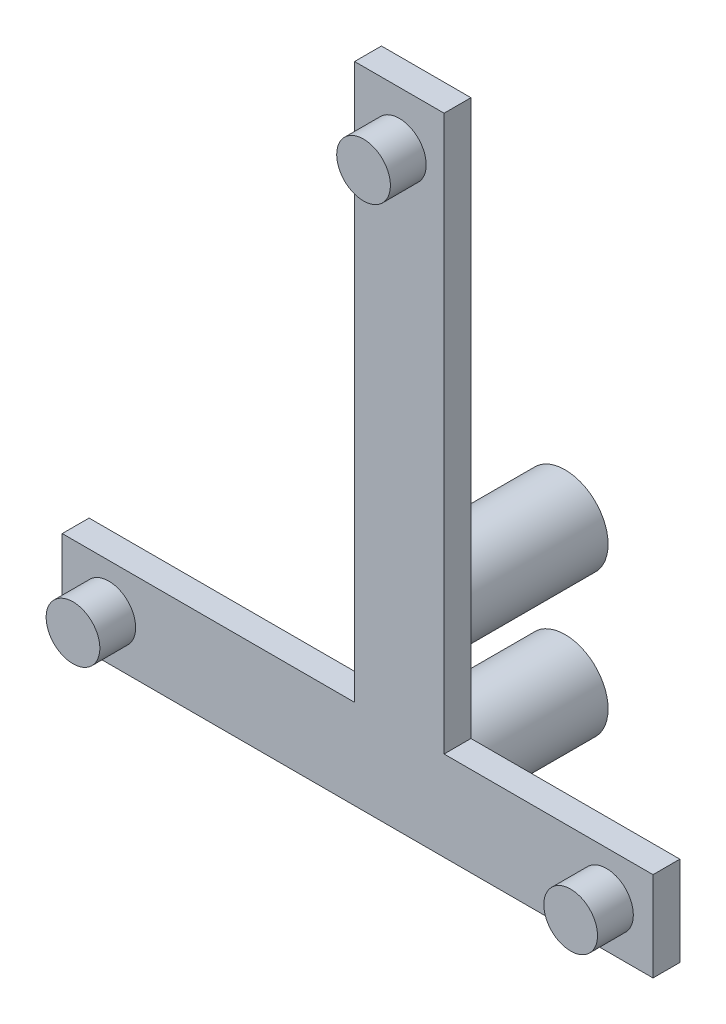
ISO-10303-21;
HEADER;
FILE_DESCRIPTION(('STEP AP214'),'2;1');
FILE_NAME('part.step','',(''),(''),'','','');
FILE_SCHEMA(('AUTOMOTIVE_DESIGN { 1 0 10303 214 1 1 1 1 }'));
ENDSEC;
DATA;
#1=APPLICATION_CONTEXT('core data for automotive mechanical design processes');
#2=APPLICATION_PROTOCOL_DEFINITION('international standard','automotive_design',2000,#1);
#3=PRODUCT_CONTEXT('',#1,'mechanical');
#4=PRODUCT('Part','Part','',(#3));
#5=PRODUCT_RELATED_PRODUCT_CATEGORY('part','',(#4));
#6=PRODUCT_DEFINITION_FORMATION('','',#4);
#7=PRODUCT_DEFINITION_CONTEXT('part definition',#1,'design');
#8=PRODUCT_DEFINITION('design','',#6,#7);
#9=PRODUCT_DEFINITION_SHAPE('','',#8);
#10=(LENGTH_UNIT() NAMED_UNIT(*) SI_UNIT(.MILLI.,.METRE.));
#11=(NAMED_UNIT(*) PLANE_ANGLE_UNIT() SI_UNIT($,.RADIAN.));
#12=(NAMED_UNIT(*) SI_UNIT($,.STERADIAN.) SOLID_ANGLE_UNIT());
#13=UNCERTAINTY_MEASURE_WITH_UNIT(LENGTH_MEASURE(1.E-05),#10,'distance_accuracy_value','');
#14=(GEOMETRIC_REPRESENTATION_CONTEXT(3) GLOBAL_UNCERTAINTY_ASSIGNED_CONTEXT((#13)) GLOBAL_UNIT_ASSIGNED_CONTEXT((#10,
#11,#12)) REPRESENTATION_CONTEXT('',''));
#15=CARTESIAN_POINT('',(0.,0.,0.));
#16=DIRECTION('',(0.,0.,1.));
#17=DIRECTION('',(1.,0.,0.));
#18=AXIS2_PLACEMENT_3D('',#15,#16,#17);
#19=CARTESIAN_POINT('',(-139.561248012313,21.0705350306475,1.5));
#20=DIRECTION('',(1.,0.,0.));
#21=DIRECTION('',(0.,0.,-1.));
#22=AXIS2_PLACEMENT_3D('',#19,#20,#21);
#23=PLANE('',#22);
#24=DIRECTION('',(0.,-1.,0.));
#25=VECTOR('',#24,1.);
#26=CARTESIAN_POINT('',(-139.561248012313,21.0705350306475,0.));
#27=LINE('',#26,#25);
#28=CARTESIAN_POINT('',(-139.561248012313,21.0705350306475,0.));
#29=VERTEX_POINT('',#28);
#30=CARTESIAN_POINT('',(-139.561248012313,16.0705350306475,0.));
#31=VERTEX_POINT('',#30);
#32=EDGE_CURVE('E132',#29,#31,#27,.T.);
#33=ORIENTED_EDGE('',*,*,#32,.T.);
#34=DIRECTION('',(0.,0.,-1.));
#35=VECTOR('',#34,1.);
#36=CARTESIAN_POINT('',(-139.561248012313,16.0705350306475,1.5));
#37=LINE('',#36,#35);
#38=CARTESIAN_POINT('',(-139.561248012313,16.0705350306475,1.5));
#39=VERTEX_POINT('',#38);
#40=EDGE_CURVE('E160',#39,#31,#37,.T.);
#41=ORIENTED_EDGE('',*,*,#40,.F.);
#42=DIRECTION('',(0.,-1.,0.));
#43=VECTOR('',#42,1.);
#44=CARTESIAN_POINT('',(-139.561248012313,21.0705350306475,1.5));
#45=LINE('',#44,#43);
#46=CARTESIAN_POINT('',(-139.561248012313,21.0705350306475,1.5));
#47=VERTEX_POINT('',#46);
#48=EDGE_CURVE('E147',#47,#39,#45,.T.);
#49=ORIENTED_EDGE('',*,*,#48,.F.);
#50=DIRECTION('',(0.,0.,-1.));
#51=VECTOR('',#50,1.);
#52=CARTESIAN_POINT('',(-139.561248012313,21.0705350306475,1.5));
#53=LINE('',#52,#51);
#54=EDGE_CURVE('E128',#47,#29,#53,.T.);
#55=ORIENTED_EDGE('',*,*,#54,.T.);
#56=EDGE_LOOP('',(#33,#41,#49,#55));
#57=FACE_BOUND('',#56,.T.);
#58=ADVANCED_FACE('F35',(#57),#23,.F.);
#59=CARTESIAN_POINT('',(-139.561248012313,16.0705350306475,1.5));
#60=DIRECTION('',(0.,1.,0.));
#61=DIRECTION('',(0.,0.,1.));
#62=AXIS2_PLACEMENT_3D('',#59,#60,#61);
#63=PLANE('',#62);
#64=DIRECTION('',(1.,0.,0.));
#65=VECTOR('',#64,1.);
#66=CARTESIAN_POINT('',(-139.561248012313,16.0705350306475,0.));
#67=LINE('',#66,#65);
#68=CARTESIAN_POINT('',(-106.561248012313,16.0705350306475,0.));
#69=VERTEX_POINT('',#68);
#70=EDGE_CURVE('E135',#31,#69,#67,.T.);
#71=ORIENTED_EDGE('',*,*,#70,.T.);
#72=DIRECTION('',(0.,0.,-1.));
#73=VECTOR('',#72,1.);
#74=CARTESIAN_POINT('',(-106.561248012313,16.0705350306475,1.5));
#75=LINE('',#74,#73);
#76=CARTESIAN_POINT('',(-106.561248012313,16.0705350306475,1.5));
#77=VERTEX_POINT('',#76);
#78=EDGE_CURVE('E157',#77,#69,#75,.T.);
#79=ORIENTED_EDGE('',*,*,#78,.F.);
#80=DIRECTION('',(1.,0.,0.));
#81=VECTOR('',#80,1.);
#82=CARTESIAN_POINT('',(-139.561248012313,16.0705350306475,1.5));
#83=LINE('',#82,#81);
#84=EDGE_CURVE('E95',#39,#77,#83,.T.);
#85=ORIENTED_EDGE('',*,*,#84,.F.);
#86=ORIENTED_EDGE('',*,*,#40,.T.);
#87=EDGE_LOOP('',(#71,#79,#85,#86));
#88=FACE_BOUND('',#87,.T.);
#89=ADVANCED_FACE('F218',(#88),#63,.F.);
#90=CARTESIAN_POINT('',(-106.561248012313,16.0705350306475,1.5));
#91=DIRECTION('',(-1.,0.,0.));
#92=DIRECTION('',(0.,0.,1.));
#93=AXIS2_PLACEMENT_3D('',#90,#91,#92);
#94=PLANE('',#93);
#95=DIRECTION('',(0.,1.,0.));
#96=VECTOR('',#95,1.);
#97=CARTESIAN_POINT('',(-106.561248012313,16.0705350306475,0.));
#98=LINE('',#97,#96);
#99=CARTESIAN_POINT('',(-106.561248012313,21.0705350306475,0.));
#100=VERTEX_POINT('',#99);
#101=EDGE_CURVE('E138',#69,#100,#98,.T.);
#102=ORIENTED_EDGE('',*,*,#101,.T.);
#103=DIRECTION('',(0.,0.,-1.));
#104=VECTOR('',#103,1.);
#105=CARTESIAN_POINT('',(-106.561248012313,21.0705350306475,1.5));
#106=LINE('',#105,#104);
#107=CARTESIAN_POINT('',(-106.561248012313,21.0705350306475,1.5));
#108=VERTEX_POINT('',#107);
#109=EDGE_CURVE('E154',#108,#100,#106,.T.);
#110=ORIENTED_EDGE('',*,*,#109,.F.);
#111=DIRECTION('',(0.,1.,0.));
#112=VECTOR('',#111,1.);
#113=CARTESIAN_POINT('',(-106.561248012313,16.0705350306475,1.5));
#114=LINE('',#113,#112);
#115=EDGE_CURVE('E186',#77,#108,#114,.T.);
#116=ORIENTED_EDGE('',*,*,#115,.F.);
#117=ORIENTED_EDGE('',*,*,#78,.T.);
#118=EDGE_LOOP('',(#102,#110,#116,#117));
#119=FACE_BOUND('',#118,.T.);
#120=ADVANCED_FACE('F222',(#119),#94,.F.);
#121=CARTESIAN_POINT('',(-106.561248012313,21.0705350306475,1.5));
#122=DIRECTION('',(0.,-1.,0.));
#123=DIRECTION('',(1.,0.,0.));
#124=AXIS2_PLACEMENT_3D('',#121,#122,#123);
#125=PLANE('',#124);
#126=DIRECTION('',(-1.,0.,0.));
#127=VECTOR('',#126,1.);
#128=CARTESIAN_POINT('',(-106.561248012313,21.0705350306475,0.));
#129=LINE('',#128,#127);
#130=CARTESIAN_POINT('',(-118.231248012313,21.0705350306475,0.));
#131=VERTEX_POINT('',#130);
#132=EDGE_CURVE('E140',#100,#131,#129,.T.);
#133=ORIENTED_EDGE('',*,*,#132,.T.);
#134=DIRECTION('',(0.,0.,-1.));
#135=VECTOR('',#134,1.);
#136=CARTESIAN_POINT('',(-118.231248012313,21.0705350306475,1.5));
#137=LINE('',#136,#135);
#138=CARTESIAN_POINT('',(-118.231248012313,21.0705350306475,1.5));
#139=VERTEX_POINT('',#138);
#140=EDGE_CURVE('E151',#139,#131,#137,.T.);
#141=ORIENTED_EDGE('',*,*,#140,.F.);
#142=DIRECTION('',(-1.,0.,0.));
#143=VECTOR('',#142,1.);
#144=CARTESIAN_POINT('',(-106.561248012313,21.0705350306475,1.5));
#145=LINE('',#144,#143);
#146=EDGE_CURVE('E188',#108,#139,#145,.T.);
#147=ORIENTED_EDGE('',*,*,#146,.F.);
#148=ORIENTED_EDGE('',*,*,#109,.T.);
#149=EDGE_LOOP('',(#133,#141,#147,#148));
#150=FACE_BOUND('',#149,.T.);
#151=ADVANCED_FACE('F194',(#150),#125,.F.);
#152=CARTESIAN_POINT('',(-118.231248012313,21.0705350306475,1.5));
#153=DIRECTION('',(-1.,0.,0.));
#154=DIRECTION('',(0.,0.,1.));
#155=AXIS2_PLACEMENT_3D('',#152,#153,#154);
#156=PLANE('',#155);
#157=DIRECTION('',(0.,1.,0.));
#158=VECTOR('',#157,1.);
#159=CARTESIAN_POINT('',(-118.231248012313,21.0705350306475,0.));
#160=LINE('',#159,#158);
#161=CARTESIAN_POINT('',(-118.231248012313,52.0705350306475,0.));
#162=VERTEX_POINT('',#161);
#163=EDGE_CURVE('E142',#131,#162,#160,.T.);
#164=ORIENTED_EDGE('',*,*,#163,.T.);
#165=DIRECTION('',(0.,0.,-1.));
#166=VECTOR('',#165,1.);
#167=CARTESIAN_POINT('',(-118.231248012313,52.0705350306475,1.5));
#168=LINE('',#167,#166);
#169=CARTESIAN_POINT('',(-118.231248012313,52.0705350306475,1.5));
#170=VERTEX_POINT('',#169);
#171=EDGE_CURVE('E123',#170,#162,#168,.T.);
#172=ORIENTED_EDGE('',*,*,#171,.F.);
#173=DIRECTION('',(0.,1.,0.));
#174=VECTOR('',#173,1.);
#175=CARTESIAN_POINT('',(-118.231248012313,21.0705350306475,1.5));
#176=LINE('',#175,#174);
#177=EDGE_CURVE('E114',#139,#170,#176,.T.);
#178=ORIENTED_EDGE('',*,*,#177,.F.);
#179=ORIENTED_EDGE('',*,*,#140,.T.);
#180=EDGE_LOOP('',(#164,#172,#178,#179));
#181=FACE_BOUND('',#180,.T.);
#182=ADVANCED_FACE('F198',(#181),#156,.F.);
#183=CARTESIAN_POINT('',(-118.231248012313,52.0705350306475,1.5));
#184=DIRECTION('',(0.,-1.,0.));
#185=DIRECTION('',(0.,0.,-1.));
#186=AXIS2_PLACEMENT_3D('',#183,#184,#185);
#187=PLANE('',#186);
#188=DIRECTION('',(-1.,0.,0.));
#189=VECTOR('',#188,1.);
#190=CARTESIAN_POINT('',(-118.231248012313,52.0705350306475,0.));
#191=LINE('',#190,#189);
#192=CARTESIAN_POINT('',(-123.231248012313,52.0705350306475,0.));
#193=VERTEX_POINT('',#192);
#194=EDGE_CURVE('E122',#162,#193,#191,.T.);
#195=ORIENTED_EDGE('',*,*,#194,.T.);
#196=DIRECTION('',(0.,0.,-1.));
#197=VECTOR('',#196,1.);
#198=CARTESIAN_POINT('',(-123.231248012313,52.0705350306475,1.5));
#199=LINE('',#198,#197);
#200=CARTESIAN_POINT('',(-123.231248012313,52.0705350306475,1.5));
#201=VERTEX_POINT('',#200);
#202=EDGE_CURVE('E119',#201,#193,#199,.T.);
#203=ORIENTED_EDGE('',*,*,#202,.F.);
#204=DIRECTION('',(-1.,0.,0.));
#205=VECTOR('',#204,1.);
#206=CARTESIAN_POINT('',(-118.231248012313,52.0705350306475,1.5));
#207=LINE('',#206,#205);
#208=EDGE_CURVE('E108',#170,#201,#207,.T.);
#209=ORIENTED_EDGE('',*,*,#208,.F.);
#210=ORIENTED_EDGE('',*,*,#171,.T.);
#211=EDGE_LOOP('',(#195,#203,#209,#210));
#212=FACE_BOUND('',#211,.T.);
#213=ADVANCED_FACE('F120',(#212),#187,.F.);
#214=CARTESIAN_POINT('',(-123.231248012313,52.0705350306475,1.5));
#215=DIRECTION('',(1.,0.,0.));
#216=DIRECTION('',(0.,1.,0.));
#217=AXIS2_PLACEMENT_3D('',#214,#215,#216);
#218=PLANE('',#217);
#219=DIRECTION('',(0.,-1.,0.));
#220=VECTOR('',#219,1.);
#221=CARTESIAN_POINT('',(-123.231248012313,52.0705350306475,0.));
#222=LINE('',#221,#220);
#223=CARTESIAN_POINT('',(-123.231248012313,21.0705350306475,0.));
#224=VERTEX_POINT('',#223);
#225=EDGE_CURVE('E80',#193,#224,#222,.T.);
#226=ORIENTED_EDGE('',*,*,#225,.T.);
#227=DIRECTION('',(0.,0.,-1.));
#228=VECTOR('',#227,1.);
#229=CARTESIAN_POINT('',(-123.231248012313,21.0705350306475,1.5));
#230=LINE('',#229,#228);
#231=CARTESIAN_POINT('',(-123.231248012313,21.0705350306475,1.5));
#232=VERTEX_POINT('',#231);
#233=EDGE_CURVE('E124',#232,#224,#230,.T.);
#234=ORIENTED_EDGE('',*,*,#233,.F.);
#235=DIRECTION('',(0.,-1.,0.));
#236=VECTOR('',#235,1.);
#237=CARTESIAN_POINT('',(-123.231248012313,52.0705350306475,1.5));
#238=LINE('',#237,#236);
#239=EDGE_CURVE('E112',#201,#232,#238,.T.);
#240=ORIENTED_EDGE('',*,*,#239,.F.);
#241=ORIENTED_EDGE('',*,*,#202,.T.);
#242=EDGE_LOOP('',(#226,#234,#240,#241));
#243=FACE_BOUND('',#242,.T.);
#244=ADVANCED_FACE('F126',(#243),#218,.F.);
#245=CARTESIAN_POINT('',(-123.231248012313,21.0705350306475,1.5));
#246=DIRECTION('',(0.,-1.,0.));
#247=DIRECTION('',(1.,0.,0.));
#248=AXIS2_PLACEMENT_3D('',#245,#246,#247);
#249=PLANE('',#248);
#250=DIRECTION('',(-1.,0.,0.));
#251=VECTOR('',#250,1.);
#252=CARTESIAN_POINT('',(-123.231248012313,21.0705350306475,0.));
#253=LINE('',#252,#251);
#254=EDGE_CURVE('E86',#224,#29,#253,.T.);
#255=ORIENTED_EDGE('',*,*,#254,.T.);
#256=ORIENTED_EDGE('',*,*,#54,.F.);
#257=DIRECTION('',(-1.,0.,0.));
#258=VECTOR('',#257,1.);
#259=CARTESIAN_POINT('',(-123.231248012313,21.0705350306475,1.5));
#260=LINE('',#259,#258);
#261=EDGE_CURVE('E51',#232,#47,#260,.T.);
#262=ORIENTED_EDGE('',*,*,#261,.F.);
#263=ORIENTED_EDGE('',*,*,#233,.T.);
#264=EDGE_LOOP('',(#255,#256,#262,#263));
#265=FACE_BOUND('',#264,.T.);
#266=ADVANCED_FACE('F206',(#265),#249,.F.);
#267=CARTESIAN_POINT('',(0.,0.,1.5));
#268=DIRECTION('',(0.,0.,1.));
#269=DIRECTION('',(1.,0.,0.));
#270=AXIS2_PLACEMENT_3D('',#267,#268,#269);
#271=PLANE('',#270);
#272=CARTESIAN_POINT('',(-120.731248012313,49.0705350306475,1.5));
#273=DIRECTION('',(0.,0.,1.));
#274=DIRECTION('',(1.,0.,0.));
#275=AXIS2_PLACEMENT_3D('',#272,#273,#274);
#276=CIRCLE('',#275,1.5);
#277=CARTESIAN_POINT('',(-119.231248012313,49.0705350306475,1.5));
#278=VERTEX_POINT('',#277);
#279=EDGE_CURVE('E163',#278,#278,#276,.T.);
#280=ORIENTED_EDGE('',*,*,#279,.F.);
#281=EDGE_LOOP('',(#280));
#282=FACE_BOUND('',#281,.T.);
#283=CARTESIAN_POINT('',(-109.161248012313,18.5705350306475,1.5));
#284=DIRECTION('',(0.,0.,1.));
#285=DIRECTION('',(1.,0.,0.));
#286=AXIS2_PLACEMENT_3D('',#283,#284,#285);
#287=CIRCLE('',#286,1.5);
#288=CARTESIAN_POINT('',(-107.661248012313,18.5705350306475,1.5));
#289=VERTEX_POINT('',#288);
#290=EDGE_CURVE('E167',#289,#289,#287,.T.);
#291=ORIENTED_EDGE('',*,*,#290,.F.);
#292=EDGE_LOOP('',(#291));
#293=FACE_BOUND('',#292,.T.);
#294=CARTESIAN_POINT('',(-136.961248012313,18.5705350306475,1.5));
#295=DIRECTION('',(0.,0.,1.));
#296=DIRECTION('',(1.,0.,0.));
#297=AXIS2_PLACEMENT_3D('',#294,#295,#296);
#298=CIRCLE('',#297,1.5);
#299=CARTESIAN_POINT('',(-135.461248012313,18.5705350306475,1.5));
#300=VERTEX_POINT('',#299);
#301=EDGE_CURVE('E161',#300,#300,#298,.T.);
#302=ORIENTED_EDGE('',*,*,#301,.F.);
#303=EDGE_LOOP('',(#302));
#304=FACE_BOUND('',#303,.T.);
#305=ORIENTED_EDGE('',*,*,#48,.T.);
#306=ORIENTED_EDGE('',*,*,#84,.T.);
#307=ORIENTED_EDGE('',*,*,#115,.T.);
#308=ORIENTED_EDGE('',*,*,#146,.T.);
#309=ORIENTED_EDGE('',*,*,#177,.T.);
#310=ORIENTED_EDGE('',*,*,#208,.T.);
#311=ORIENTED_EDGE('',*,*,#239,.T.);
#312=ORIENTED_EDGE('',*,*,#261,.T.);
#313=EDGE_LOOP('',(#305,#306,#307,#308,#309,#310,#311,#312));
#314=FACE_BOUND('',#313,.T.);
#315=ADVANCED_FACE('F110',(#282,#293,#304,#314),#271,.T.);
#316=CARTESIAN_POINT('',(0.,0.,0.));
#317=DIRECTION('',(0.,0.,1.));
#318=DIRECTION('',(1.,0.,0.));
#319=AXIS2_PLACEMENT_3D('',#316,#317,#318);
#320=PLANE('',#319);
#321=CARTESIAN_POINT('',(-120.731248012313,26.5405350306475,0.));
#322=DIRECTION('',(0.,0.,1.));
#323=DIRECTION('',(1.,0.,0.));
#324=AXIS2_PLACEMENT_3D('',#321,#322,#323);
#325=CIRCLE('',#324,2.4);
#326=CARTESIAN_POINT('',(-118.331248012313,26.5405350306475,0.));
#327=VERTEX_POINT('',#326);
#328=EDGE_CURVE('E11',#327,#327,#325,.F.);
#329=ORIENTED_EDGE('',*,*,#328,.F.);
#330=EDGE_LOOP('',(#329));
#331=FACE_BOUND('',#330,.T.);
#332=CARTESIAN_POINT('',(-120.731248012313,18.5705350306475,0.));
#333=DIRECTION('',(0.,0.,1.));
#334=DIRECTION('',(1.,0.,0.));
#335=AXIS2_PLACEMENT_3D('',#332,#333,#334);
#336=CIRCLE('',#335,2.4);
#337=CARTESIAN_POINT('',(-118.331248012313,18.5705350306475,0.));
#338=VERTEX_POINT('',#337);
#339=EDGE_CURVE('E43',#338,#338,#336,.F.);
#340=ORIENTED_EDGE('',*,*,#339,.F.);
#341=EDGE_LOOP('',(#340));
#342=FACE_BOUND('',#341,.T.);
#343=ORIENTED_EDGE('',*,*,#32,.F.);
#344=ORIENTED_EDGE('',*,*,#254,.F.);
#345=ORIENTED_EDGE('',*,*,#225,.F.);
#346=ORIENTED_EDGE('',*,*,#194,.F.);
#347=ORIENTED_EDGE('',*,*,#163,.F.);
#348=ORIENTED_EDGE('',*,*,#132,.F.);
#349=ORIENTED_EDGE('',*,*,#101,.F.);
#350=ORIENTED_EDGE('',*,*,#70,.F.);
#351=EDGE_LOOP('',(#343,#344,#345,#346,#347,#348,#349,#350));
#352=FACE_BOUND('',#351,.T.);
#353=ADVANCED_FACE('F201',(#331,#342,#352),#320,.F.);
#354=CARTESIAN_POINT('',(-136.961248012313,18.5705350306475,3.5));
#355=DIRECTION('',(0.,0.,-1.));
#356=DIRECTION('',(-1.,0.,0.));
#357=AXIS2_PLACEMENT_3D('',#354,#355,#356);
#358=CYLINDRICAL_SURFACE('',#357,1.5);
#359=ORIENTED_EDGE('',*,*,#301,.T.);
#360=EDGE_LOOP('',(#359));
#361=FACE_BOUND('',#360,.T.);
#362=CARTESIAN_POINT('',(-136.961248012313,18.5705350306475,3.5));
#363=DIRECTION('',(0.,0.,-1.));
#364=DIRECTION('',(-1.,0.,0.));
#365=AXIS2_PLACEMENT_3D('',#362,#363,#364);
#366=CIRCLE('',#365,1.5);
#367=CARTESIAN_POINT('',(-138.461248012313,18.5705350306475,3.5));
#368=VERTEX_POINT('',#367);
#369=EDGE_CURVE('E136',#368,#368,#366,.T.);
#370=ORIENTED_EDGE('',*,*,#369,.T.);
#371=EDGE_LOOP('',(#370));
#372=FACE_BOUND('',#371,.T.);
#373=ADVANCED_FACE('F259',(#361,#372),#358,.T.);
#374=CARTESIAN_POINT('',(-136.961248012313,18.5705350306475,3.5));
#375=DIRECTION('',(0.,0.,-1.));
#376=DIRECTION('',(-1.,0.,0.));
#377=AXIS2_PLACEMENT_3D('',#374,#375,#376);
#378=PLANE('',#377);
#379=ORIENTED_EDGE('',*,*,#369,.F.);
#380=EDGE_LOOP('',(#379));
#381=FACE_BOUND('',#380,.T.);
#382=ADVANCED_FACE('F264',(#381),#378,.F.);
#383=CARTESIAN_POINT('',(-109.161248012313,18.5705350306475,3.5));
#384=DIRECTION('',(0.,0.,-1.));
#385=DIRECTION('',(-1.,0.,0.));
#386=AXIS2_PLACEMENT_3D('',#383,#384,#385);
#387=CYLINDRICAL_SURFACE('',#386,1.5);
#388=ORIENTED_EDGE('',*,*,#290,.T.);
#389=EDGE_LOOP('',(#388));
#390=FACE_BOUND('',#389,.T.);
#391=CARTESIAN_POINT('',(-109.161248012313,18.5705350306475,3.5));
#392=DIRECTION('',(0.,0.,-1.));
#393=DIRECTION('',(-1.,0.,0.));
#394=AXIS2_PLACEMENT_3D('',#391,#392,#393);
#395=CIRCLE('',#394,1.5);
#396=CARTESIAN_POINT('',(-110.661248012313,18.5705350306475,3.5));
#397=VERTEX_POINT('',#396);
#398=EDGE_CURVE('E177',#397,#397,#395,.T.);
#399=ORIENTED_EDGE('',*,*,#398,.T.);
#400=EDGE_LOOP('',(#399));
#401=FACE_BOUND('',#400,.T.);
#402=ADVANCED_FACE('F274',(#390,#401),#387,.T.);
#403=CARTESIAN_POINT('',(-109.161248012313,18.5705350306475,3.5));
#404=DIRECTION('',(0.,0.,-1.));
#405=DIRECTION('',(-1.,0.,0.));
#406=AXIS2_PLACEMENT_3D('',#403,#404,#405);
#407=PLANE('',#406);
#408=ORIENTED_EDGE('',*,*,#398,.F.);
#409=EDGE_LOOP('',(#408));
#410=FACE_BOUND('',#409,.T.);
#411=ADVANCED_FACE('F284',(#410),#407,.F.);
#412=CARTESIAN_POINT('',(-120.731248012313,49.0705350306475,3.5));
#413=DIRECTION('',(0.,0.,-1.));
#414=DIRECTION('',(-1.,0.,0.));
#415=AXIS2_PLACEMENT_3D('',#412,#413,#414);
#416=CYLINDRICAL_SURFACE('',#415,1.5);
#417=ORIENTED_EDGE('',*,*,#279,.T.);
#418=EDGE_LOOP('',(#417));
#419=FACE_BOUND('',#418,.T.);
#420=CARTESIAN_POINT('',(-120.731248012313,49.0705350306475,3.5));
#421=DIRECTION('',(0.,0.,-1.));
#422=DIRECTION('',(-1.,0.,0.));
#423=AXIS2_PLACEMENT_3D('',#420,#421,#422);
#424=CIRCLE('',#423,1.5);
#425=CARTESIAN_POINT('',(-122.231248012313,49.0705350306475,3.5));
#426=VERTEX_POINT('',#425);
#427=EDGE_CURVE('E175',#426,#426,#424,.T.);
#428=ORIENTED_EDGE('',*,*,#427,.T.);
#429=EDGE_LOOP('',(#428));
#430=FACE_BOUND('',#429,.T.);
#431=ADVANCED_FACE('F294',(#419,#430),#416,.T.);
#432=CARTESIAN_POINT('',(-120.731248012313,49.0705350306475,3.5));
#433=DIRECTION('',(0.,0.,-1.));
#434=DIRECTION('',(-1.,0.,0.));
#435=AXIS2_PLACEMENT_3D('',#432,#433,#434);
#436=PLANE('',#435);
#437=ORIENTED_EDGE('',*,*,#427,.F.);
#438=EDGE_LOOP('',(#437));
#439=FACE_BOUND('',#438,.T.);
#440=ADVANCED_FACE('F304',(#439),#436,.F.);
#441=CARTESIAN_POINT('',(-120.731248012313,18.5705350306475,-7.76));
#442=DIRECTION('',(0.,0.,1.));
#443=DIRECTION('',(1.,0.,0.));
#444=AXIS2_PLACEMENT_3D('',#441,#442,#443);
#445=CYLINDRICAL_SURFACE('',#444,2.4);
#446=CARTESIAN_POINT('',(-120.731248012313,18.5705350306475,-7.76));
#447=DIRECTION('',(0.,0.,-1.));
#448=DIRECTION('',(-1.,0.,0.));
#449=AXIS2_PLACEMENT_3D('',#446,#447,#448);
#450=CIRCLE('',#449,2.4);
#451=CARTESIAN_POINT('',(-123.131248012313,18.5705350306475,-7.76));
#452=VERTEX_POINT('',#451);
#453=EDGE_CURVE('E366',#452,#452,#450,.T.);
#454=ORIENTED_EDGE('',*,*,#453,.F.);
#455=EDGE_LOOP('',(#454));
#456=FACE_BOUND('',#455,.T.);
#457=ORIENTED_EDGE('',*,*,#339,.T.);
#458=EDGE_LOOP('',(#457));
#459=FACE_BOUND('',#458,.T.);
#460=ADVANCED_FACE('F313',(#456,#459),#445,.T.);
#461=CARTESIAN_POINT('',(-120.731248012313,18.5705350306475,-7.76));
#462=DIRECTION('',(0.,0.,-1.));
#463=DIRECTION('',(-1.,0.,0.));
#464=AXIS2_PLACEMENT_3D('',#461,#462,#463);
#465=PLANE('',#464);
#466=ORIENTED_EDGE('',*,*,#453,.T.);
#467=EDGE_LOOP('',(#466));
#468=FACE_BOUND('',#467,.T.);
#469=ADVANCED_FACE('F329',(#468),#465,.T.);
#470=CARTESIAN_POINT('',(-120.731248012313,26.5405350306475,-7.76));
#471=DIRECTION('',(0.,0.,1.));
#472=DIRECTION('',(1.,0.,0.));
#473=AXIS2_PLACEMENT_3D('',#470,#471,#472);
#474=CYLINDRICAL_SURFACE('',#473,2.4);
#475=CARTESIAN_POINT('',(-120.731248012313,26.5405350306475,-7.76));
#476=DIRECTION('',(0.,0.,-1.));
#477=DIRECTION('',(-1.,0.,0.));
#478=AXIS2_PLACEMENT_3D('',#475,#476,#477);
#479=CIRCLE('',#478,2.4);
#480=CARTESIAN_POINT('',(-123.131248012313,26.5405350306475,-7.76));
#481=VERTEX_POINT('',#480);
#482=EDGE_CURVE('E365',#481,#481,#479,.T.);
#483=ORIENTED_EDGE('',*,*,#482,.F.);
#484=EDGE_LOOP('',(#483));
#485=FACE_BOUND('',#484,.T.);
#486=ORIENTED_EDGE('',*,*,#328,.T.);
#487=EDGE_LOOP('',(#486));
#488=FACE_BOUND('',#487,.T.);
#489=ADVANCED_FACE('F339',(#485,#488),#474,.T.);
#490=CARTESIAN_POINT('',(-120.731248012313,26.5405350306475,-7.76));
#491=DIRECTION('',(0.,0.,-1.));
#492=DIRECTION('',(-1.,0.,0.));
#493=AXIS2_PLACEMENT_3D('',#490,#491,#492);
#494=PLANE('',#493);
#495=ORIENTED_EDGE('',*,*,#482,.T.);
#496=EDGE_LOOP('',(#495));
#497=FACE_BOUND('',#496,.T.);
#498=ADVANCED_FACE('F349',(#497),#494,.T.);
#499=CLOSED_SHELL('',(#58,#89,#120,#151,#182,#213,#244,#266,#315,#353,#373,#382,#402,#411,#431,
#440,#460,#469,#489,#498));
#500=MANIFOLD_SOLID_BREP('B2',#499);
#501=ADVANCED_BREP_SHAPE_REPRESENTATION('',(#18,#500),#14);
#502=SHAPE_DEFINITION_REPRESENTATION(#9,#501);
ENDSEC;
END-ISO-10303-21;
